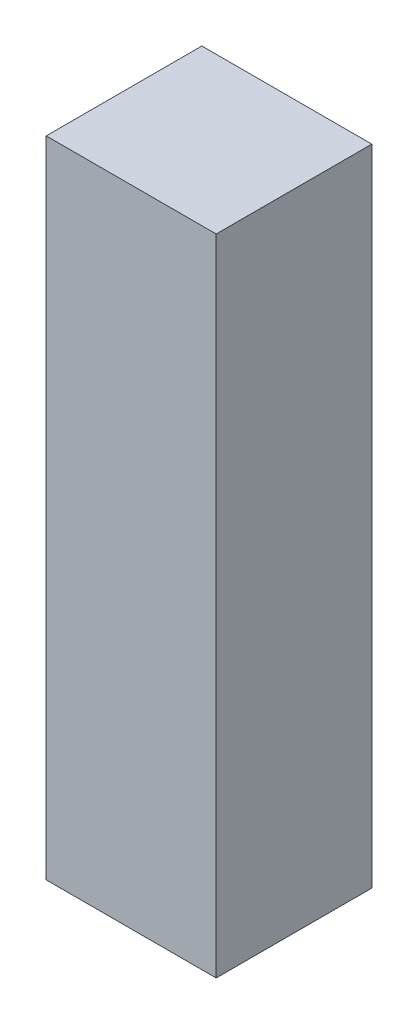
ISO-10303-21;
HEADER;
FILE_DESCRIPTION(('STEP AP214'),'2;1');
FILE_NAME('part.step','',(''),(''),'','','');
FILE_SCHEMA(('AUTOMOTIVE_DESIGN { 1 0 10303 214 1 1 1 1 }'));
ENDSEC;
DATA;
#1=APPLICATION_CONTEXT('core data for automotive mechanical design processes');
#2=APPLICATION_PROTOCOL_DEFINITION('international standard','automotive_design',2000,#1);
#3=PRODUCT_CONTEXT('',#1,'mechanical');
#4=PRODUCT('Part','Part','',(#3));
#5=PRODUCT_RELATED_PRODUCT_CATEGORY('part','',(#4));
#6=PRODUCT_DEFINITION_FORMATION('','',#4);
#7=PRODUCT_DEFINITION_CONTEXT('part definition',#1,'design');
#8=PRODUCT_DEFINITION('design','',#6,#7);
#9=PRODUCT_DEFINITION_SHAPE('','',#8);
#10=(LENGTH_UNIT() NAMED_UNIT(*) SI_UNIT(.MILLI.,.METRE.));
#11=(NAMED_UNIT(*) PLANE_ANGLE_UNIT() SI_UNIT($,.RADIAN.));
#12=(NAMED_UNIT(*) SI_UNIT($,.STERADIAN.) SOLID_ANGLE_UNIT());
#13=UNCERTAINTY_MEASURE_WITH_UNIT(LENGTH_MEASURE(1.E-05),#10,'distance_accuracy_value','');
#14=(GEOMETRIC_REPRESENTATION_CONTEXT(3) GLOBAL_UNCERTAINTY_ASSIGNED_CONTEXT((#13)) GLOBAL_UNIT_ASSIGNED_CONTEXT((#10,
#11,#12)) REPRESENTATION_CONTEXT('',''));
#15=CARTESIAN_POINT('',(0.,0.,0.));
#16=DIRECTION('',(0.,0.,1.));
#17=DIRECTION('',(1.,0.,0.));
#18=AXIS2_PLACEMENT_3D('',#15,#16,#17);
#19=CARTESIAN_POINT('',(-13.65,103.5,12.5));
#20=DIRECTION('',(1.,0.,0.));
#21=DIRECTION('',(0.,0.,-1.));
#22=AXIS2_PLACEMENT_3D('',#19,#20,#21);
#23=PLANE('',#22);
#24=DIRECTION('',(0.,0.,1.));
#25=VECTOR('',#24,1.);
#26=CARTESIAN_POINT('',(-13.65,0.,12.5));
#27=LINE('',#26,#25);
#28=CARTESIAN_POINT('',(-13.65,0.,-12.5));
#29=VERTEX_POINT('',#28);
#30=CARTESIAN_POINT('',(-13.65,0.,12.5));
#31=VERTEX_POINT('',#30);
#32=EDGE_CURVE('E107',#29,#31,#27,.T.);
#33=ORIENTED_EDGE('',*,*,#32,.T.);
#34=DIRECTION('',(0.,-1.,0.));
#35=VECTOR('',#34,1.);
#36=CARTESIAN_POINT('',(-13.65,103.5,12.5));
#37=LINE('',#36,#35);
#38=CARTESIAN_POINT('',(-13.65,103.5,12.5));
#39=VERTEX_POINT('',#38);
#40=EDGE_CURVE('E11',#39,#31,#37,.T.);
#41=ORIENTED_EDGE('',*,*,#40,.F.);
#42=DIRECTION('',(0.,0.,1.));
#43=VECTOR('',#42,1.);
#44=CARTESIAN_POINT('',(-13.65,103.5,12.5));
#45=LINE('',#44,#43);
#46=CARTESIAN_POINT('',(-13.65,103.5,-12.5));
#47=VERTEX_POINT('',#46);
#48=EDGE_CURVE('E91',#47,#39,#45,.T.);
#49=ORIENTED_EDGE('',*,*,#48,.F.);
#50=DIRECTION('',(0.,-1.,0.));
#51=VECTOR('',#50,1.);
#52=CARTESIAN_POINT('',(-13.65,103.5,-12.5));
#53=LINE('',#52,#51);
#54=EDGE_CURVE('E103',#47,#29,#53,.T.);
#55=ORIENTED_EDGE('',*,*,#54,.T.);
#56=EDGE_LOOP('',(#33,#41,#49,#55));
#57=FACE_BOUND('',#56,.T.);
#58=ADVANCED_FACE('F39',(#57),#23,.F.);
#59=CARTESIAN_POINT('',(13.65,103.5,12.5));
#60=DIRECTION('',(0.,0.,-1.));
#61=DIRECTION('',(-1.,0.,0.));
#62=AXIS2_PLACEMENT_3D('',#59,#60,#61);
#63=PLANE('',#62);
#64=DIRECTION('',(1.,0.,0.));
#65=VECTOR('',#64,1.);
#66=CARTESIAN_POINT('',(13.65,0.,12.5));
#67=LINE('',#66,#65);
#68=CARTESIAN_POINT('',(13.65,0.,12.5));
#69=VERTEX_POINT('',#68);
#70=EDGE_CURVE('E96',#31,#69,#67,.T.);
#71=ORIENTED_EDGE('',*,*,#70,.T.);
#72=DIRECTION('',(0.,-1.,0.));
#73=VECTOR('',#72,1.);
#74=CARTESIAN_POINT('',(13.65,103.5,12.5));
#75=LINE('',#74,#73);
#76=CARTESIAN_POINT('',(13.65,103.5,12.5));
#77=VERTEX_POINT('',#76);
#78=EDGE_CURVE('E48',#77,#69,#75,.T.);
#79=ORIENTED_EDGE('',*,*,#78,.F.);
#80=DIRECTION('',(1.,0.,0.));
#81=VECTOR('',#80,1.);
#82=CARTESIAN_POINT('',(13.65,103.5,12.5));
#83=LINE('',#82,#81);
#84=EDGE_CURVE('E86',#39,#77,#83,.T.);
#85=ORIENTED_EDGE('',*,*,#84,.F.);
#86=ORIENTED_EDGE('',*,*,#40,.T.);
#87=EDGE_LOOP('',(#71,#79,#85,#86));
#88=FACE_BOUND('',#87,.T.);
#89=ADVANCED_FACE('F95',(#88),#63,.F.);
#90=CARTESIAN_POINT('',(13.65,103.5,12.5));
#91=DIRECTION('',(-1.,0.,0.));
#92=DIRECTION('',(0.,0.,1.));
#93=AXIS2_PLACEMENT_3D('',#90,#91,#92);
#94=PLANE('',#93);
#95=DIRECTION('',(0.,0.,-1.));
#96=VECTOR('',#95,1.);
#97=CARTESIAN_POINT('',(13.65,0.,12.5));
#98=LINE('',#97,#96);
#99=CARTESIAN_POINT('',(13.65,0.,-12.5));
#100=VERTEX_POINT('',#99);
#101=EDGE_CURVE('E73',#69,#100,#98,.T.);
#102=ORIENTED_EDGE('',*,*,#101,.T.);
#103=DIRECTION('',(0.,-1.,0.));
#104=VECTOR('',#103,1.);
#105=CARTESIAN_POINT('',(13.65,103.5,-12.5));
#106=LINE('',#105,#104);
#107=CARTESIAN_POINT('',(13.65,103.5,-12.5));
#108=VERTEX_POINT('',#107);
#109=EDGE_CURVE('E98',#108,#100,#106,.T.);
#110=ORIENTED_EDGE('',*,*,#109,.F.);
#111=DIRECTION('',(0.,0.,-1.));
#112=VECTOR('',#111,1.);
#113=CARTESIAN_POINT('',(13.65,103.5,12.5));
#114=LINE('',#113,#112);
#115=EDGE_CURVE('E89',#77,#108,#114,.T.);
#116=ORIENTED_EDGE('',*,*,#115,.F.);
#117=ORIENTED_EDGE('',*,*,#78,.T.);
#118=EDGE_LOOP('',(#102,#110,#116,#117));
#119=FACE_BOUND('',#118,.T.);
#120=ADVANCED_FACE('F99',(#119),#94,.F.);
#121=CARTESIAN_POINT('',(13.65,103.5,-12.5));
#122=DIRECTION('',(0.,0.,1.));
#123=DIRECTION('',(1.,0.,0.));
#124=AXIS2_PLACEMENT_3D('',#121,#122,#123);
#125=PLANE('',#124);
#126=DIRECTION('',(-1.,0.,0.));
#127=VECTOR('',#126,1.);
#128=CARTESIAN_POINT('',(13.65,0.,-12.5));
#129=LINE('',#128,#127);
#130=EDGE_CURVE('E79',#100,#29,#129,.T.);
#131=ORIENTED_EDGE('',*,*,#130,.T.);
#132=ORIENTED_EDGE('',*,*,#54,.F.);
#133=DIRECTION('',(-1.,0.,0.));
#134=VECTOR('',#133,1.);
#135=CARTESIAN_POINT('',(13.65,103.5,-12.5));
#136=LINE('',#135,#134);
#137=EDGE_CURVE('E56',#108,#47,#136,.T.);
#138=ORIENTED_EDGE('',*,*,#137,.F.);
#139=ORIENTED_EDGE('',*,*,#109,.T.);
#140=EDGE_LOOP('',(#131,#132,#138,#139));
#141=FACE_BOUND('',#140,.T.);
#142=ADVANCED_FACE('F120',(#141),#125,.F.);
#143=CARTESIAN_POINT('',(0.,103.5,0.));
#144=DIRECTION('',(0.,1.,0.));
#145=DIRECTION('',(0.,0.,1.));
#146=AXIS2_PLACEMENT_3D('',#143,#144,#145);
#147=PLANE('',#146);
#148=ORIENTED_EDGE('',*,*,#48,.T.);
#149=ORIENTED_EDGE('',*,*,#84,.T.);
#150=ORIENTED_EDGE('',*,*,#115,.T.);
#151=ORIENTED_EDGE('',*,*,#137,.T.);
#152=EDGE_LOOP('',(#148,#149,#150,#151));
#153=FACE_BOUND('',#152,.T.);
#154=ADVANCED_FACE('F87',(#153),#147,.T.);
#155=CARTESIAN_POINT('',(0.,0.,0.));
#156=DIRECTION('',(0.,1.,0.));
#157=DIRECTION('',(0.,0.,1.));
#158=AXIS2_PLACEMENT_3D('',#155,#156,#157);
#159=PLANE('',#158);
#160=ORIENTED_EDGE('',*,*,#32,.F.);
#161=ORIENTED_EDGE('',*,*,#130,.F.);
#162=ORIENTED_EDGE('',*,*,#101,.F.);
#163=ORIENTED_EDGE('',*,*,#70,.F.);
#164=EDGE_LOOP('',(#160,#161,#162,#163));
#165=FACE_BOUND('',#164,.T.);
#166=ADVANCED_FACE('F123',(#165),#159,.F.);
#167=CLOSED_SHELL('',(#58,#89,#120,#142,#154,#166));
#168=MANIFOLD_SOLID_BREP('B2',#167);
#169=ADVANCED_BREP_SHAPE_REPRESENTATION('',(#18,#168),#14);
#170=SHAPE_DEFINITION_REPRESENTATION(#9,#169);
ENDSEC;
END-ISO-10303-21;
